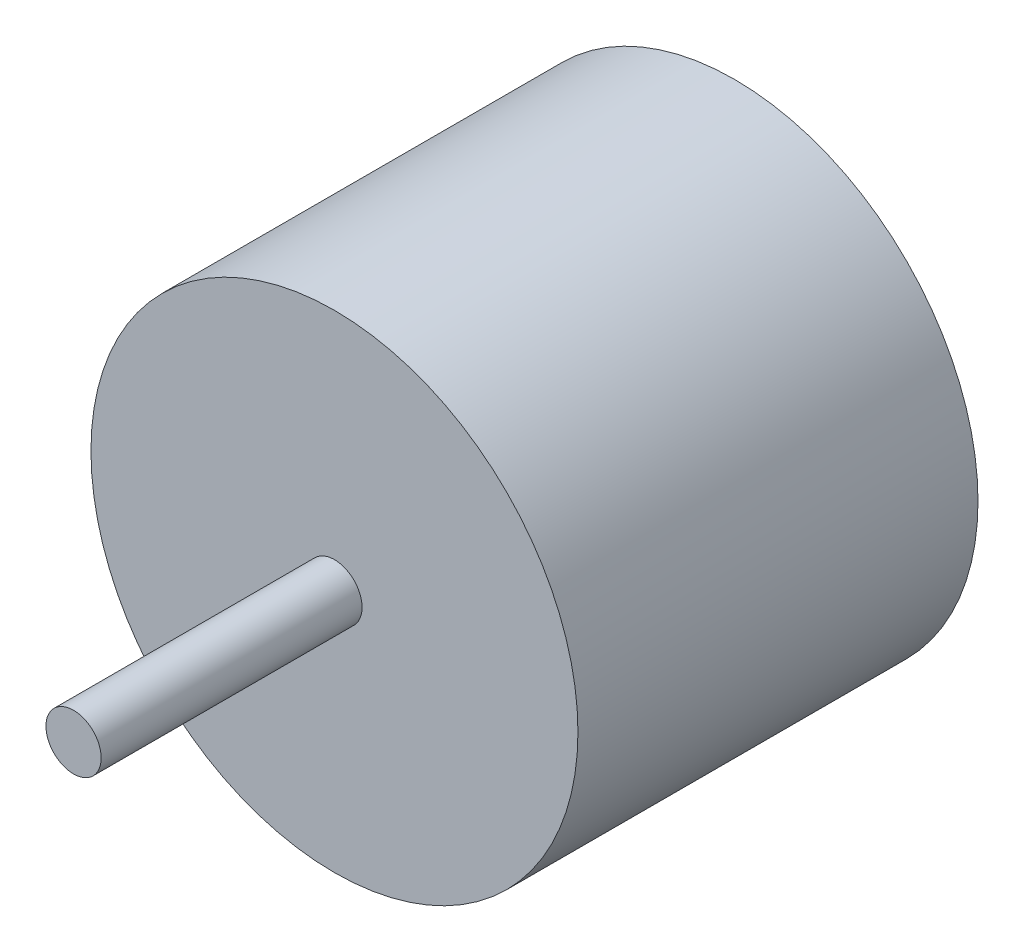
ISO-10303-21;
HEADER;
FILE_DESCRIPTION(('STEP AP214'),'2;1');
FILE_NAME('part.step','',(''),(''),'','','');
FILE_SCHEMA(('AUTOMOTIVE_DESIGN { 1 0 10303 214 1 1 1 1 }'));
ENDSEC;
DATA;
#1=APPLICATION_CONTEXT('core data for automotive mechanical design processes');
#2=APPLICATION_PROTOCOL_DEFINITION('international standard','automotive_design',2000,#1);
#3=PRODUCT_CONTEXT('',#1,'mechanical');
#4=PRODUCT('Part','Part','',(#3));
#5=PRODUCT_RELATED_PRODUCT_CATEGORY('part','',(#4));
#6=PRODUCT_DEFINITION_FORMATION('','',#4);
#7=PRODUCT_DEFINITION_CONTEXT('part definition',#1,'design');
#8=PRODUCT_DEFINITION('design','',#6,#7);
#9=PRODUCT_DEFINITION_SHAPE('','',#8);
#10=(LENGTH_UNIT() NAMED_UNIT(*) SI_UNIT(.MILLI.,.METRE.));
#11=(NAMED_UNIT(*) PLANE_ANGLE_UNIT() SI_UNIT($,.RADIAN.));
#12=(NAMED_UNIT(*) SI_UNIT($,.STERADIAN.) SOLID_ANGLE_UNIT());
#13=UNCERTAINTY_MEASURE_WITH_UNIT(LENGTH_MEASURE(1.E-05),#10,'distance_accuracy_value','');
#14=(GEOMETRIC_REPRESENTATION_CONTEXT(3) GLOBAL_UNCERTAINTY_ASSIGNED_CONTEXT((#13)) GLOBAL_UNIT_ASSIGNED_CONTEXT((#10,
#11,#12)) REPRESENTATION_CONTEXT('',''));
#15=CARTESIAN_POINT('',(0.,0.,0.));
#16=DIRECTION('',(0.,0.,1.));
#17=DIRECTION('',(1.,0.,0.));
#18=AXIS2_PLACEMENT_3D('',#15,#16,#17);
#19=CARTESIAN_POINT('',(0.,0.,-23.));
#20=DIRECTION('',(0.,0.,1.));
#21=DIRECTION('',(1.,0.,0.));
#22=AXIS2_PLACEMENT_3D('',#19,#20,#21);
#23=CYLINDRICAL_SURFACE('',#22,14.);
#24=CARTESIAN_POINT('',(0.,0.,-23.));
#25=DIRECTION('',(0.,0.,1.));
#26=DIRECTION('',(1.,0.,0.));
#27=AXIS2_PLACEMENT_3D('',#24,#25,#26);
#28=CIRCLE('',#27,14.);
#29=CARTESIAN_POINT('',(14.,0.,-23.));
#30=VERTEX_POINT('',#29);
#31=EDGE_CURVE('E10',#30,#30,#28,.T.);
#32=ORIENTED_EDGE('',*,*,#31,.T.);
#33=EDGE_LOOP('',(#32));
#34=FACE_BOUND('',#33,.T.);
#35=CARTESIAN_POINT('',(0.,0.,0.));
#36=DIRECTION('',(0.,0.,1.));
#37=DIRECTION('',(1.,0.,0.));
#38=AXIS2_PLACEMENT_3D('',#35,#36,#37);
#39=CIRCLE('',#38,14.);
#40=CARTESIAN_POINT('',(14.,0.,0.));
#41=VERTEX_POINT('',#40);
#42=EDGE_CURVE('E43',#41,#41,#39,.T.);
#43=ORIENTED_EDGE('',*,*,#42,.F.);
#44=EDGE_LOOP('',(#43));
#45=FACE_BOUND('',#44,.T.);
#46=ADVANCED_FACE('F40',(#34,#45),#23,.T.);
#47=CARTESIAN_POINT('',(0.,0.,-23.));
#48=DIRECTION('',(0.,0.,1.));
#49=DIRECTION('',(1.,0.,0.));
#50=AXIS2_PLACEMENT_3D('',#47,#48,#49);
#51=PLANE('',#50);
#52=ORIENTED_EDGE('',*,*,#31,.F.);
#53=EDGE_LOOP('',(#52));
#54=FACE_BOUND('',#53,.T.);
#55=ADVANCED_FACE('F70',(#54),#51,.F.);
#56=CARTESIAN_POINT('',(0.,0.,0.));
#57=DIRECTION('',(0.,0.,1.));
#58=DIRECTION('',(1.,0.,0.));
#59=AXIS2_PLACEMENT_3D('',#56,#57,#58);
#60=PLANE('',#59);
#61=CARTESIAN_POINT('',(0.,0.,0.));
#62=DIRECTION('',(0.,0.,1.));
#63=DIRECTION('',(1.,0.,0.));
#64=AXIS2_PLACEMENT_3D('',#61,#62,#63);
#65=CIRCLE('',#64,1.5875);
#66=CARTESIAN_POINT('',(1.5875,0.,0.));
#67=VERTEX_POINT('',#66);
#68=EDGE_CURVE('E53',#67,#67,#65,.T.);
#69=ORIENTED_EDGE('',*,*,#68,.F.);
#70=EDGE_LOOP('',(#69));
#71=FACE_BOUND('',#70,.T.);
#72=ORIENTED_EDGE('',*,*,#42,.T.);
#73=EDGE_LOOP('',(#72));
#74=FACE_BOUND('',#73,.T.);
#75=ADVANCED_FACE('F64',(#71,#74),#60,.T.);
#76=CARTESIAN_POINT('',(0.,0.,15.));
#77=DIRECTION('',(0.,0.,-1.));
#78=DIRECTION('',(-1.,0.,0.));
#79=AXIS2_PLACEMENT_3D('',#76,#77,#78);
#80=CYLINDRICAL_SURFACE('',#79,1.5875);
#81=CARTESIAN_POINT('',(0.,0.,15.));
#82=DIRECTION('',(0.,0.,1.));
#83=DIRECTION('',(1.,0.,0.));
#84=AXIS2_PLACEMENT_3D('',#81,#82,#83);
#85=CIRCLE('',#84,1.5875);
#86=CARTESIAN_POINT('',(1.5875,0.,15.));
#87=VERTEX_POINT('',#86);
#88=EDGE_CURVE('E51',#87,#87,#85,.T.);
#89=ORIENTED_EDGE('',*,*,#88,.F.);
#90=EDGE_LOOP('',(#89));
#91=FACE_BOUND('',#90,.T.);
#92=ORIENTED_EDGE('',*,*,#68,.T.);
#93=EDGE_LOOP('',(#92));
#94=FACE_BOUND('',#93,.T.);
#95=ADVANCED_FACE('F61',(#91,#94),#80,.T.);
#96=CARTESIAN_POINT('',(0.,0.,15.));
#97=DIRECTION('',(0.,0.,1.));
#98=DIRECTION('',(1.,0.,0.));
#99=AXIS2_PLACEMENT_3D('',#96,#97,#98);
#100=PLANE('',#99);
#101=ORIENTED_EDGE('',*,*,#88,.T.);
#102=EDGE_LOOP('',(#101));
#103=FACE_BOUND('',#102,.T.);
#104=ADVANCED_FACE('F59',(#103),#100,.T.);
#105=CLOSED_SHELL('',(#46,#55,#75,#95,#104));
#106=MANIFOLD_SOLID_BREP('B2',#105);
#107=ADVANCED_BREP_SHAPE_REPRESENTATION('',(#18,#106),#14);
#108=SHAPE_DEFINITION_REPRESENTATION(#9,#107);
ENDSEC;
END-ISO-10303-21;
